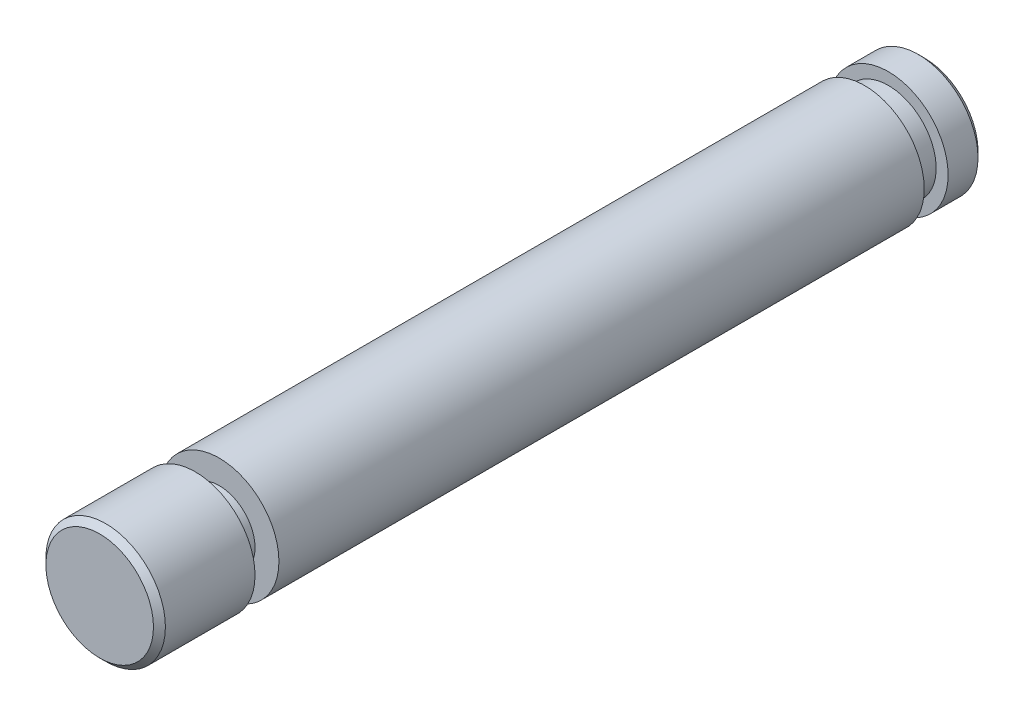
ISO-10303-21;
HEADER;
FILE_DESCRIPTION(('STEP AP214'),'2;1');
FILE_NAME('part.step','',(''),(''),'','','');
FILE_SCHEMA(('AUTOMOTIVE_DESIGN { 1 0 10303 214 1 1 1 1 }'));
ENDSEC;
DATA;
#1=APPLICATION_CONTEXT('core data for automotive mechanical design processes');
#2=APPLICATION_PROTOCOL_DEFINITION('international standard','automotive_design',2000,#1);
#3=PRODUCT_CONTEXT('',#1,'mechanical');
#4=PRODUCT('Part','Part','',(#3));
#5=PRODUCT_RELATED_PRODUCT_CATEGORY('part','',(#4));
#6=PRODUCT_DEFINITION_FORMATION('','',#4);
#7=PRODUCT_DEFINITION_CONTEXT('part definition',#1,'design');
#8=PRODUCT_DEFINITION('design','',#6,#7);
#9=PRODUCT_DEFINITION_SHAPE('','',#8);
#10=(LENGTH_UNIT() NAMED_UNIT(*) SI_UNIT(.MILLI.,.METRE.));
#11=(NAMED_UNIT(*) PLANE_ANGLE_UNIT() SI_UNIT($,.RADIAN.));
#12=(NAMED_UNIT(*) SI_UNIT($,.STERADIAN.) SOLID_ANGLE_UNIT());
#13=UNCERTAINTY_MEASURE_WITH_UNIT(LENGTH_MEASURE(1.E-05),#10,'distance_accuracy_value','');
#14=(GEOMETRIC_REPRESENTATION_CONTEXT(3) GLOBAL_UNCERTAINTY_ASSIGNED_CONTEXT((#13)) GLOBAL_UNIT_ASSIGNED_CONTEXT((#10,
#11,#12)) REPRESENTATION_CONTEXT('',''));
#15=CARTESIAN_POINT('',(0.,0.,0.));
#16=DIRECTION('',(0.,0.,1.));
#17=DIRECTION('',(1.,0.,0.));
#18=AXIS2_PLACEMENT_3D('',#15,#16,#17);
#19=CARTESIAN_POINT('',(0.,0.,-31.5));
#20=DIRECTION('',(0.,0.,-1.));
#21=DIRECTION('',(-1.,0.,0.));
#22=AXIS2_PLACEMENT_3D('',#19,#20,#21);
#23=PLANE('',#22);
#24=DIRECTION('',(-1.,0.,0.));
#25=VECTOR('',#24,1.);
#26=CARTESIAN_POINT('',(0.,1.5,-31.5));
#27=LINE('',#26,#25);
#28=CARTESIAN_POINT('',(-3.70809924354783,1.5,-31.5));
#29=VERTEX_POINT('',#28);
#30=CARTESIAN_POINT('',(-4.76969600708473,1.5,-31.5));
#31=VERTEX_POINT('',#30);
#32=EDGE_CURVE('E173',#29,#31,#27,.T.);
#33=ORIENTED_EDGE('',*,*,#32,.F.);
#34=CARTESIAN_POINT('',(0.,0.,-31.5));
#35=DIRECTION('',(0.,0.,-1.));
#36=DIRECTION('',(-1.,0.,0.));
#37=AXIS2_PLACEMENT_3D('',#34,#35,#36);
#38=CIRCLE('',#37,4.);
#39=CARTESIAN_POINT('',(-3.70809924354783,-1.5,-31.5));
#40=VERTEX_POINT('',#39);
#41=EDGE_CURVE('E181',#29,#40,#38,.T.);
#42=ORIENTED_EDGE('',*,*,#41,.T.);
#43=DIRECTION('',(-1.,0.,0.));
#44=VECTOR('',#43,1.);
#45=CARTESIAN_POINT('',(0.,-1.5,-31.5));
#46=LINE('',#45,#44);
#47=CARTESIAN_POINT('',(-4.76969600708473,-1.5,-31.5));
#48=VERTEX_POINT('',#47);
#49=EDGE_CURVE('E162',#40,#48,#46,.T.);
#50=ORIENTED_EDGE('',*,*,#49,.T.);
#51=CARTESIAN_POINT('',(0.,0.,-31.5));
#52=DIRECTION('',(0.,0.,-1.));
#53=DIRECTION('',(-1.,0.,0.));
#54=AXIS2_PLACEMENT_3D('',#51,#52,#53);
#55=CIRCLE('',#54,5.);
#56=EDGE_CURVE('E187',#31,#48,#55,.T.);
#57=ORIENTED_EDGE('',*,*,#56,.F.);
#58=EDGE_LOOP('',(#33,#42,#50,#57));
#59=FACE_BOUND('',#58,.T.);
#60=ADVANCED_FACE('F51',(#59),#23,.F.);
#61=CARTESIAN_POINT('',(0.,0.,-29.5));
#62=DIRECTION('',(0.,0.,-1.));
#63=DIRECTION('',(-1.,0.,0.));
#64=AXIS2_PLACEMENT_3D('',#61,#62,#63);
#65=PLANE('',#64);
#66=CARTESIAN_POINT('',(0.,0.,-29.5));
#67=DIRECTION('',(0.,0.,-1.));
#68=DIRECTION('',(-1.,0.,0.));
#69=AXIS2_PLACEMENT_3D('',#66,#67,#68);
#70=CIRCLE('',#69,4.);
#71=CARTESIAN_POINT('',(-3.70809924354783,1.5,-29.5));
#72=VERTEX_POINT('',#71);
#73=CARTESIAN_POINT('',(-3.70809924354783,-1.5,-29.5));
#74=VERTEX_POINT('',#73);
#75=EDGE_CURVE('E180',#72,#74,#70,.T.);
#76=ORIENTED_EDGE('',*,*,#75,.F.);
#77=DIRECTION('',(-1.,0.,0.));
#78=VECTOR('',#77,1.);
#79=CARTESIAN_POINT('',(0.,1.5,-29.5));
#80=LINE('',#79,#78);
#81=CARTESIAN_POINT('',(-4.76969600708473,1.5,-29.5));
#82=VERTEX_POINT('',#81);
#83=EDGE_CURVE('E177',#72,#82,#80,.T.);
#84=ORIENTED_EDGE('',*,*,#83,.T.);
#85=CARTESIAN_POINT('',(0.,0.,-29.5));
#86=DIRECTION('',(0.,0.,-1.));
#87=DIRECTION('',(-1.,0.,0.));
#88=AXIS2_PLACEMENT_3D('',#85,#86,#87);
#89=CIRCLE('',#88,5.);
#90=CARTESIAN_POINT('',(-4.76969600708473,-1.5,-29.5));
#91=VERTEX_POINT('',#90);
#92=EDGE_CURVE('E184',#82,#91,#89,.T.);
#93=ORIENTED_EDGE('',*,*,#92,.T.);
#94=DIRECTION('',(-1.,0.,0.));
#95=VECTOR('',#94,1.);
#96=CARTESIAN_POINT('',(0.,-1.5,-29.5));
#97=LINE('',#96,#95);
#98=EDGE_CURVE('E168',#74,#91,#97,.T.);
#99=ORIENTED_EDGE('',*,*,#98,.F.);
#100=EDGE_LOOP('',(#76,#84,#93,#99));
#101=FACE_BOUND('',#100,.T.);
#102=ADVANCED_FACE('F240',(#101),#65,.T.);
#103=CARTESIAN_POINT('',(0.,0.,-31.5));
#104=DIRECTION('',(0.,0.,1.));
#105=DIRECTION('',(1.,0.,0.));
#106=AXIS2_PLACEMENT_3D('',#103,#104,#105);
#107=CYLINDRICAL_SURFACE('',#106,4.);
#108=DIRECTION('',(0.,0.,1.));
#109=VECTOR('',#108,1.);
#110=CARTESIAN_POINT('',(-3.70809924354783,1.5,-31.5));
#111=LINE('',#110,#109);
#112=EDGE_CURVE('E175',#72,#29,#111,.F.);
#113=ORIENTED_EDGE('',*,*,#112,.F.);
#114=ORIENTED_EDGE('',*,*,#75,.T.);
#115=DIRECTION('',(0.,0.,1.));
#116=VECTOR('',#115,1.);
#117=CARTESIAN_POINT('',(-3.70809924354783,-1.5,-31.5));
#118=LINE('',#117,#116);
#119=EDGE_CURVE('E165',#74,#40,#118,.F.);
#120=ORIENTED_EDGE('',*,*,#119,.T.);
#121=ORIENTED_EDGE('',*,*,#41,.F.);
#122=EDGE_LOOP('',(#113,#114,#120,#121));
#123=FACE_BOUND('',#122,.T.);
#124=ADVANCED_FACE('F236',(#123),#107,.T.);
#125=CARTESIAN_POINT('',(0.,0.,-34.5));
#126=DIRECTION('',(0.,0.,1.));
#127=DIRECTION('',(1.,0.,0.));
#128=AXIS2_PLACEMENT_3D('',#125,#126,#127);
#129=PLANE('',#128);
#130=DIRECTION('',(1.,0.,0.));
#131=VECTOR('',#130,1.);
#132=CARTESIAN_POINT('',(-5.,1.5,-34.5));
#133=LINE('',#132,#131);
#134=CARTESIAN_POINT('',(-4.24264068711929,1.5,-34.5));
#135=VERTEX_POINT('',#134);
#136=CARTESIAN_POINT('',(-3.2,1.5,-34.5));
#137=VERTEX_POINT('',#136);
#138=EDGE_CURVE('E157',#135,#137,#133,.T.);
#139=ORIENTED_EDGE('',*,*,#138,.F.);
#140=CARTESIAN_POINT('',(0.,0.,-34.5));
#141=DIRECTION('',(0.,0.,1.));
#142=DIRECTION('',(1.,0.,0.));
#143=AXIS2_PLACEMENT_3D('',#140,#141,#142);
#144=CIRCLE('',#143,4.5);
#145=CARTESIAN_POINT('',(-4.24264068711929,-1.5,-34.5));
#146=VERTEX_POINT('',#145);
#147=EDGE_CURVE('E213',#135,#146,#144,.F.);
#148=ORIENTED_EDGE('',*,*,#147,.T.);
#149=DIRECTION('',(1.,0.,0.));
#150=VECTOR('',#149,1.);
#151=CARTESIAN_POINT('',(-5.,-1.5,-34.5));
#152=LINE('',#151,#150);
#153=CARTESIAN_POINT('',(-3.2,-1.5,-34.5));
#154=VERTEX_POINT('',#153);
#155=EDGE_CURVE('E74',#146,#154,#152,.T.);
#156=ORIENTED_EDGE('',*,*,#155,.T.);
#157=DIRECTION('',(0.,-1.,0.));
#158=VECTOR('',#157,1.);
#159=CARTESIAN_POINT('',(-3.2,1.5,-34.5));
#160=LINE('',#159,#158);
#161=EDGE_CURVE('E146',#137,#154,#160,.T.);
#162=ORIENTED_EDGE('',*,*,#161,.F.);
#163=EDGE_LOOP('',(#139,#148,#156,#162));
#164=FACE_BOUND('',#163,.T.);
#165=ADVANCED_FACE('F239',(#164),#129,.F.);
#166=CARTESIAN_POINT('',(0.,0.,34.5));
#167=DIRECTION('',(0.,0.,-1.));
#168=DIRECTION('',(-1.,0.,0.));
#169=AXIS2_PLACEMENT_3D('',#166,#167,#168);
#170=CYLINDRICAL_SURFACE('',#169,5.);
#171=DIRECTION('',(0.,0.,-1.));
#172=VECTOR('',#171,1.);
#173=CARTESIAN_POINT('',(-4.76969600708473,1.5,34.5));
#174=LINE('',#173,#172);
#175=CARTESIAN_POINT('',(-4.76969600708473,1.5,-34.));
#176=VERTEX_POINT('',#175);
#177=EDGE_CURVE('E171',#31,#176,#174,.T.);
#178=ORIENTED_EDGE('',*,*,#177,.F.);
#179=ORIENTED_EDGE('',*,*,#56,.T.);
#180=DIRECTION('',(0.,0.,-1.));
#181=VECTOR('',#180,1.);
#182=CARTESIAN_POINT('',(-4.76969600708473,-1.5,34.5));
#183=LINE('',#182,#181);
#184=CARTESIAN_POINT('',(-4.76969600708473,-1.5,-34.));
#185=VERTEX_POINT('',#184);
#186=EDGE_CURVE('E156',#48,#185,#183,.T.);
#187=ORIENTED_EDGE('',*,*,#186,.T.);
#188=CARTESIAN_POINT('',(0.,0.,-34.));
#189=DIRECTION('',(0.,0.,1.));
#190=DIRECTION('',(1.,0.,0.));
#191=AXIS2_PLACEMENT_3D('',#188,#189,#190);
#192=CIRCLE('',#191,5.);
#193=EDGE_CURVE('E210',#185,#176,#192,.T.);
#194=ORIENTED_EDGE('',*,*,#193,.T.);
#195=EDGE_LOOP('',(#178,#179,#187,#194));
#196=FACE_BOUND('',#195,.T.);
#197=ADVANCED_FACE('F266',(#196),#170,.T.);
#198=CARTESIAN_POINT('',(0.,0.,-34.));
#199=DIRECTION('',(0.,0.,1.));
#200=DIRECTION('',(1.,0.,0.));
#201=AXIS2_PLACEMENT_3D('',#198,#199,#200);
#202=CONICAL_SURFACE('',#201,5.,0.785398163397443);
#203=ORIENTED_EDGE('',*,*,#147,.F.);
#204=CARTESIAN_POINT('',(-2.16230427521784,1.5,-36.3683541692269));
#205=CARTESIAN_POINT('',(-2.26170328637368,1.5,-36.2866237657248));
#206=CARTESIAN_POINT('',(-2.36025529148759,1.5,-36.2038798963738));
#207=CARTESIAN_POINT('',(-2.55600046714587,1.5,-36.036817134977));
#208=CARTESIAN_POINT('',(-2.65319376997426,1.5,-35.9524983981551));
#209=CARTESIAN_POINT('',(-2.84655338557445,1.5,-35.7827415296879));
#210=CARTESIAN_POINT('',(-2.94271993398821,1.5,-35.6973036653634));
#211=CARTESIAN_POINT('',(-3.13426650601756,1.5,-35.5255461820675));
#212=CARTESIAN_POINT('',(-3.22964650729755,1.5,-35.439226538211));
#213=CARTESIAN_POINT('',(-3.51479588177239,1.5,-35.1793145483203));
#214=CARTESIAN_POINT('',(-3.70364165468618,1.5,-35.0047097694588));
#215=CARTESIAN_POINT('',(-4.0797362886616,1.5,-34.6537692558707));
#216=CARTESIAN_POINT('',(-4.26698503752829,1.5,-34.4774334013733));
#217=CARTESIAN_POINT('',(-4.64263193370613,1.5,-34.1214350657471));
#218=CARTESIAN_POINT('',(-4.83101642797462,1.5,-33.9417581905171));
#219=CARTESIAN_POINT('',(-5.20695991744704,1.5,-33.5815548756563));
#220=CARTESIAN_POINT('',(-5.39451893661307,1.5,-33.4010284610051));
#221=CARTESIAN_POINT('',(-5.76908741339747,1.5,-33.0392956468262));
#222=CARTESIAN_POINT('',(-5.95609669115696,1.5,-32.8580890611849));
#223=CARTESIAN_POINT('',(-6.32964554688914,1.5,-32.4951934856952));
#224=CARTESIAN_POINT('',(-6.51618512637662,1.5,-32.3135044974066));
#225=CARTESIAN_POINT('',(-6.70255839168424,1.5,-32.1316458307731));
#226=B_SPLINE_CURVE_WITH_KNOTS('',3,(#204,#205,#206,#207,#208,#209,#210,#211,#212,#213,#214,
#215,#216,#217,#218,#219,#220,#221,#222,#223,#224,#225),.UNSPECIFIED.,.F.,.F.,(4,2,2,2,2,2,2,2,
2,2,4),(0.,0.386035334138068,0.772032818161416,1.15793972383208,1.54385755063091,
2.31542460009282,3.08704541483162,3.86803599873153,4.64900376030176,5.43020358119426,
6.21140087945938),.UNSPECIFIED.);
#227=EDGE_CURVE('E67',#135,#176,#226,.T.);
#228=ORIENTED_EDGE('',*,*,#227,.T.);
#229=ORIENTED_EDGE('',*,*,#193,.F.);
#230=CARTESIAN_POINT('',(-2.16230427521784,-1.5,-36.3683541692269));
#231=CARTESIAN_POINT('',(-2.26170328637368,-1.5,-36.2866237657248));
#232=CARTESIAN_POINT('',(-2.36025529148759,-1.5,-36.2038798963738));
#233=CARTESIAN_POINT('',(-2.55600046714587,-1.5,-36.036817134977));
#234=CARTESIAN_POINT('',(-2.65319376997426,-1.5,-35.9524983981551));
#235=CARTESIAN_POINT('',(-2.84655338557445,-1.5,-35.7827415296879));
#236=CARTESIAN_POINT('',(-2.94271993398821,-1.5,-35.6973036653634));
#237=CARTESIAN_POINT('',(-3.13426650601756,-1.5,-35.5255461820675));
#238=CARTESIAN_POINT('',(-3.22964650729755,-1.5,-35.439226538211));
#239=CARTESIAN_POINT('',(-3.51479588177239,-1.5,-35.1793145483203));
#240=CARTESIAN_POINT('',(-3.70364165468618,-1.5,-35.0047097694588));
#241=CARTESIAN_POINT('',(-4.07973628866161,-1.5,-34.6537692558707));
#242=CARTESIAN_POINT('',(-4.26698503752829,-1.5,-34.4774334013733));
#243=CARTESIAN_POINT('',(-4.64263193370613,-1.5,-34.1214350657471));
#244=CARTESIAN_POINT('',(-4.83101642797462,-1.5,-33.9417581905171));
#245=CARTESIAN_POINT('',(-5.20695991744704,-1.5,-33.5815548756563));
#246=CARTESIAN_POINT('',(-5.39451893661307,-1.5,-33.4010284610051));
#247=CARTESIAN_POINT('',(-5.76908741339747,-1.5,-33.0392956468262));
#248=CARTESIAN_POINT('',(-5.95609669115697,-1.5,-32.8580890611849));
#249=CARTESIAN_POINT('',(-6.32964554688914,-1.5,-32.4951934856952));
#250=CARTESIAN_POINT('',(-6.51618512637662,-1.5,-32.3135044974066));
#251=CARTESIAN_POINT('',(-6.70255839168424,-1.5,-32.1316458307731));
#252=B_SPLINE_CURVE_WITH_KNOTS('',3,(#230,#231,#232,#233,#234,#235,#236,#237,#238,#239,#240,
#241,#242,#243,#244,#245,#246,#247,#248,#249,#250,#251),.UNSPECIFIED.,.F.,.F.,(4,2,2,2,2,2,2,2,
2,2,4),(0.,0.386035334138068,0.772032818161416,1.15793972383208,1.54385755063091,
2.31542460009283,3.08704541483162,3.86803599873152,4.64900376030176,5.43020358119427,
6.21140087945938),.UNSPECIFIED.);
#253=EDGE_CURVE('E216',#146,#185,#252,.T.);
#254=ORIENTED_EDGE('',*,*,#253,.F.);
#255=EDGE_LOOP('',(#203,#228,#229,#254));
#256=FACE_BOUND('',#255,.T.);
#257=ADVANCED_FACE('F54',(#256),#202,.T.);
#258=CARTESIAN_POINT('',(0.,0.,24.5));
#259=DIRECTION('',(0.,0.,1.));
#260=DIRECTION('',(1.,0.,0.));
#261=AXIS2_PLACEMENT_3D('',#258,#259,#260);
#262=CIRCLE('',#261,5.);
#263=CARTESIAN_POINT('',(5.,0.,24.5));
#264=VERTEX_POINT('',#263);
#265=EDGE_CURVE('E196',#264,#264,#262,.T.);
#266=ORIENTED_EDGE('',*,*,#265,.F.);
#267=EDGE_LOOP('',(#266));
#268=FACE_BOUND('',#267,.T.);
#269=DIRECTION('',(0.,0.,-1.));
#270=VECTOR('',#269,1.);
#271=CARTESIAN_POINT('',(-4.76969600708473,1.5,34.5));
#272=LINE('',#271,#270);
#273=CARTESIAN_POINT('',(-4.76969600708473,1.5,-8.));
#274=VERTEX_POINT('',#273);
#275=EDGE_CURVE('E82',#274,#82,#272,.T.);
#276=ORIENTED_EDGE('',*,*,#275,.F.);
#277=CARTESIAN_POINT('',(-4.76969600708473,1.5,-8.));
#278=CARTESIAN_POINT('',(-4.76969249084934,1.50000085357071,-7.95882060709199));
#279=CARTESIAN_POINT('',(-4.77022997000129,1.49830317083428,-7.91766195687388));
#280=CARTESIAN_POINT('',(-4.77235095109999,1.49153785660317,-7.83565883790444));
#281=CARTESIAN_POINT('',(-4.77393421787376,1.48647098275841,-7.79481430060511));
#282=CARTESIAN_POINT('',(-4.78018490618873,1.46630203689311,-7.67340945904534));
#283=CARTESIAN_POINT('',(-4.78635370384275,1.44623120413662,-7.59369360958363));
#284=CARTESIAN_POINT('',(-4.80195952113208,1.39353102315626,-7.43896442161414));
#285=CARTESIAN_POINT('',(-4.81139539670393,1.36090607068203,-7.36394944780192));
#286=CARTESIAN_POINT('',(-4.83246571212052,1.28407841117655,-7.22040331840241));
#287=CARTESIAN_POINT('',(-4.84410117434933,1.23987031651226,-7.15187520027157));
#288=CARTESIAN_POINT('',(-4.86866835244721,1.13964850658326,-7.02113394400295));
#289=CARTESIAN_POINT('',(-4.88162755412974,1.08333433465208,-6.9591563396566));
#290=CARTESIAN_POINT('',(-4.90714811559049,0.961138919873353,-6.84536441610004));
#291=CARTESIAN_POINT('',(-4.91970940785249,0.895256063916347,-6.79355181399695));
#292=CARTESIAN_POINT('',(-4.94333239727705,0.754109921315429,-6.70053622968151));
#293=CARTESIAN_POINT('',(-4.95435770971354,0.678680819336258,-6.65957481970205));
#294=CARTESIAN_POINT('',(-4.97334469846208,0.521621185505773,-6.59101158838185));
#295=CARTESIAN_POINT('',(-4.98130716463903,0.439992259012926,-6.56340632220572));
#296=CARTESIAN_POINT('',(-4.99307639935002,0.275324697874877,-6.52312020089795));
#297=CARTESIAN_POINT('',(-4.99699549276993,0.192393125294253,-6.51003514203026));
#298=CARTESIAN_POINT('',(-5.00063202022426,0.025423571998081,-6.49788265863674));
#299=CARTESIAN_POINT('',(-5.00035024971471,-0.0586141962423633,-6.49881258029984));
#300=CARTESIAN_POINT('',(-4.99569602566267,-0.222571599946018,-6.514392908759));
#301=CARTESIAN_POINT('',(-4.99145415509187,-0.302537145464642,-6.52860534497872));
#302=CARTESIAN_POINT('',(-4.9795151369998,-0.458890052102026,-6.56963163523811));
#303=CARTESIAN_POINT('',(-4.97181780846028,-0.535277225531998,-6.59644614945594));
#304=CARTESIAN_POINT('',(-4.95365214926145,-0.683347815892217,-6.66221222164644));
#305=CARTESIAN_POINT('',(-4.94315255692525,-0.754966006044143,-6.70130164435694));
#306=CARTESIAN_POINT('',(-4.92049624651755,-0.890765529574421,-6.79039859004832));
#307=CARTESIAN_POINT('',(-4.90833915735884,-0.954945191614595,-6.84040855947884));
#308=CARTESIAN_POINT('',(-4.88311673571409,-1.07665450541275,-6.95219198808351));
#309=CARTESIAN_POINT('',(-4.87003445449553,-1.13383351478034,-7.01434386376075));
#310=CARTESIAN_POINT('',(-4.84484215114658,-1.23706769492487,-7.14749742342792));
#311=CARTESIAN_POINT('',(-4.83273241337565,-1.28311962013078,-7.21850168036553));
#312=CARTESIAN_POINT('',(-4.81077228795653,-1.36316407240863,-7.36828092844929));
#313=CARTESIAN_POINT('',(-4.80094596245948,-1.39703006341135,-7.44712717959341));
#314=CARTESIAN_POINT('',(-4.78495663653201,-1.45085886004699,-7.60972450398175));
#315=CARTESIAN_POINT('',(-4.77878803475875,-1.47084293218035,-7.69346786071438));
#316=CARTESIAN_POINT('',(-4.77314032325006,-1.4890120359008,-7.81499488907019));
#317=CARTESIAN_POINT('',(-4.77185156275267,-1.49313202989009,-7.85189073417961));
#318=CARTESIAN_POINT('',(-4.77012928611782,-1.49862355614854,-7.92585147909953));
#319=CARTESIAN_POINT('',(-4.76969451246644,-1.49999912968269,-7.96291604966386));
#320=CARTESIAN_POINT('',(-4.76969600708473,-1.5,-8.));
#321=B_SPLINE_CURVE_WITH_KNOTS('',3,(#277,#278,#279,#280,#281,#282,#283,#284,#285,#286,#287,
#288,#289,#290,#291,#292,#293,#294,#295,#296,#297,#298,#299,#300,#301,#302,#303,#304,#305,#306,
#307,#308,#309,#310,#311,#312,#313,#314,#315,#316,#317,#318,#319,#320),.UNSPECIFIED.,.F.,.F.,(4,
2,2,2,2,2,2,2,2,2,2,2,2,2,2,2,2,2,2,2,2,4),(0.,0.123459071219734,0.246890388853043,
0.492911349615211,0.738846245884325,0.984895736828093,1.23795510798803,1.49105719006936,
1.74939356197455,2.00766326783256,2.25854751319802,2.5093842528947,2.75223130012966,
2.99509107067836,3.2407824256273,3.48652887757005,3.74172568310981,3.99699683536777,
4.25484698071527,4.51230123440207,4.62365084745809,4.73483637253615),.UNSPECIFIED.);
#322=CARTESIAN_POINT('',(-4.76969600708473,-1.5,-8.));
#323=VERTEX_POINT('',#322);
#324=EDGE_CURVE('E11',#274,#323,#321,.T.);
#325=ORIENTED_EDGE('',*,*,#324,.T.);
#326=DIRECTION('',(0.,0.,-1.));
#327=VECTOR('',#326,1.);
#328=CARTESIAN_POINT('',(-4.76969600708473,-1.5,34.5));
#329=LINE('',#328,#327);
#330=EDGE_CURVE('E135',#323,#91,#329,.T.);
#331=ORIENTED_EDGE('',*,*,#330,.T.);
#332=ORIENTED_EDGE('',*,*,#92,.F.);
#333=EDGE_LOOP('',(#276,#325,#331,#332));
#334=FACE_BOUND('',#333,.T.);
#335=ADVANCED_FACE('F270',(#268,#334),#170,.T.);
#336=CARTESIAN_POINT('',(0.,0.,34.));
#337=DIRECTION('',(0.,0.,1.));
#338=DIRECTION('',(1.,0.,0.));
#339=AXIS2_PLACEMENT_3D('',#336,#337,#338);
#340=CIRCLE('',#339,5.);
#341=CARTESIAN_POINT('',(5.,0.,34.));
#342=VERTEX_POINT('',#341);
#343=EDGE_CURVE('E207',#342,#342,#340,.F.);
#344=ORIENTED_EDGE('',*,*,#343,.T.);
#345=EDGE_LOOP('',(#344));
#346=FACE_BOUND('',#345,.T.);
#347=CARTESIAN_POINT('',(0.,0.,26.5));
#348=DIRECTION('',(0.,0.,1.));
#349=DIRECTION('',(1.,0.,0.));
#350=AXIS2_PLACEMENT_3D('',#347,#348,#349);
#351=CIRCLE('',#350,5.);
#352=CARTESIAN_POINT('',(5.,0.,26.5));
#353=VERTEX_POINT('',#352);
#354=EDGE_CURVE('E199',#353,#353,#351,.T.);
#355=ORIENTED_EDGE('',*,*,#354,.T.);
#356=EDGE_LOOP('',(#355));
#357=FACE_BOUND('',#356,.T.);
#358=ADVANCED_FACE('F263',(#346,#357),#170,.T.);
#359=CARTESIAN_POINT('',(0.,0.,34.5));
#360=DIRECTION('',(0.,0.,1.));
#361=DIRECTION('',(1.,0.,0.));
#362=AXIS2_PLACEMENT_3D('',#359,#360,#361);
#363=PLANE('',#362);
#364=CARTESIAN_POINT('',(0.,0.,34.5));
#365=DIRECTION('',(0.,0.,1.));
#366=DIRECTION('',(1.,0.,0.));
#367=AXIS2_PLACEMENT_3D('',#364,#365,#366);
#368=CIRCLE('',#367,4.5);
#369=CARTESIAN_POINT('',(4.5,0.,34.5));
#370=VERTEX_POINT('',#369);
#371=EDGE_CURVE('E202',#370,#370,#368,.T.);
#372=ORIENTED_EDGE('',*,*,#371,.T.);
#373=EDGE_LOOP('',(#372));
#374=FACE_BOUND('',#373,.T.);
#375=ADVANCED_FACE('F256',(#374),#363,.T.);
#376=CARTESIAN_POINT('',(0.,0.,26.5));
#377=DIRECTION('',(0.,0.,1.));
#378=DIRECTION('',(1.,0.,0.));
#379=AXIS2_PLACEMENT_3D('',#376,#377,#378);
#380=PLANE('',#379);
#381=ORIENTED_EDGE('',*,*,#354,.F.);
#382=EDGE_LOOP('',(#381));
#383=FACE_BOUND('',#382,.T.);
#384=CARTESIAN_POINT('',(0.,0.,26.5));
#385=DIRECTION('',(0.,0.,1.));
#386=DIRECTION('',(1.,0.,0.));
#387=AXIS2_PLACEMENT_3D('',#384,#385,#386);
#388=CIRCLE('',#387,3.);
#389=CARTESIAN_POINT('',(3.,0.,26.5));
#390=VERTEX_POINT('',#389);
#391=EDGE_CURVE('E193',#390,#390,#388,.T.);
#392=ORIENTED_EDGE('',*,*,#391,.T.);
#393=EDGE_LOOP('',(#392));
#394=FACE_BOUND('',#393,.T.);
#395=ADVANCED_FACE('F253',(#383,#394),#380,.F.);
#396=CARTESIAN_POINT('',(0.,0.,24.5));
#397=DIRECTION('',(0.,0.,1.));
#398=DIRECTION('',(1.,0.,0.));
#399=AXIS2_PLACEMENT_3D('',#396,#397,#398);
#400=PLANE('',#399);
#401=ORIENTED_EDGE('',*,*,#265,.T.);
#402=EDGE_LOOP('',(#401));
#403=FACE_BOUND('',#402,.T.);
#404=CARTESIAN_POINT('',(0.,0.,24.5));
#405=DIRECTION('',(0.,0.,1.));
#406=DIRECTION('',(1.,0.,0.));
#407=AXIS2_PLACEMENT_3D('',#404,#405,#406);
#408=CIRCLE('',#407,3.);
#409=CARTESIAN_POINT('',(3.,0.,24.5));
#410=VERTEX_POINT('',#409);
#411=EDGE_CURVE('E190',#410,#410,#408,.T.);
#412=ORIENTED_EDGE('',*,*,#411,.F.);
#413=EDGE_LOOP('',(#412));
#414=FACE_BOUND('',#413,.T.);
#415=ADVANCED_FACE('F251',(#403,#414),#400,.T.);
#416=CARTESIAN_POINT('',(0.,0.,26.5));
#417=DIRECTION('',(0.,0.,-1.));
#418=DIRECTION('',(-1.,0.,0.));
#419=AXIS2_PLACEMENT_3D('',#416,#417,#418);
#420=CYLINDRICAL_SURFACE('',#419,3.);
#421=ORIENTED_EDGE('',*,*,#391,.F.);
#422=EDGE_LOOP('',(#421));
#423=FACE_BOUND('',#422,.T.);
#424=ORIENTED_EDGE('',*,*,#411,.T.);
#425=EDGE_LOOP('',(#424));
#426=FACE_BOUND('',#425,.T.);
#427=ADVANCED_FACE('F248',(#423,#426),#420,.T.);
#428=CARTESIAN_POINT('',(0.,0.,34.5));
#429=DIRECTION('',(0.,0.,-1.));
#430=DIRECTION('',(-1.,0.,0.));
#431=AXIS2_PLACEMENT_3D('',#428,#429,#430);
#432=CONICAL_SURFACE('',#431,4.5,0.78539816339745);
#433=ORIENTED_EDGE('',*,*,#343,.F.);
#434=EDGE_LOOP('',(#433));
#435=FACE_BOUND('',#434,.T.);
#436=ORIENTED_EDGE('',*,*,#371,.F.);
#437=EDGE_LOOP('',(#436));
#438=FACE_BOUND('',#437,.T.);
#439=ADVANCED_FACE('F235',(#435,#438),#432,.T.);
#440=CARTESIAN_POINT('',(-5.,0.,-8.));
#441=DIRECTION('',(1.,0.,0.));
#442=DIRECTION('',(0.,0.,-1.));
#443=AXIS2_PLACEMENT_3D('',#440,#441,#442);
#444=CYLINDRICAL_SURFACE('',#443,1.5);
#445=DIRECTION('',(1.,0.,0.));
#446=VECTOR('',#445,1.);
#447=CARTESIAN_POINT('',(-5.,1.5,-8.));
#448=LINE('',#447,#446);
#449=CARTESIAN_POINT('',(-3.2,1.5,-8.));
#450=VERTEX_POINT('',#449);
#451=EDGE_CURVE('E149',#274,#450,#448,.T.);
#452=ORIENTED_EDGE('',*,*,#451,.T.);
#453=CARTESIAN_POINT('',(-3.2,0.,-8.));
#454=DIRECTION('',(1.,0.,0.));
#455=DIRECTION('',(0.,0.,-1.));
#456=AXIS2_PLACEMENT_3D('',#453,#454,#455);
#457=CIRCLE('',#456,1.5);
#458=CARTESIAN_POINT('',(-3.2,-1.5,-8.));
#459=VERTEX_POINT('',#458);
#460=EDGE_CURVE('E144',#450,#459,#457,.T.);
#461=ORIENTED_EDGE('',*,*,#460,.T.);
#462=DIRECTION('',(1.,0.,0.));
#463=VECTOR('',#462,1.);
#464=CARTESIAN_POINT('',(-5.,-1.5,-8.));
#465=LINE('',#464,#463);
#466=EDGE_CURVE('E130',#323,#459,#465,.T.);
#467=ORIENTED_EDGE('',*,*,#466,.F.);
#468=ORIENTED_EDGE('',*,*,#324,.F.);
#469=EDGE_LOOP('',(#452,#461,#467,#468));
#470=FACE_BOUND('',#469,.T.);
#471=ADVANCED_FACE('F148',(#470),#444,.F.);
#472=CARTESIAN_POINT('',(-5.,1.5,-8.));
#473=DIRECTION('',(0.,-1.,0.));
#474=DIRECTION('',(0.,0.,-1.));
#475=AXIS2_PLACEMENT_3D('',#472,#473,#474);
#476=PLANE('',#475);
#477=ORIENTED_EDGE('',*,*,#275,.T.);
#478=ORIENTED_EDGE('',*,*,#83,.F.);
#479=ORIENTED_EDGE('',*,*,#112,.T.);
#480=ORIENTED_EDGE('',*,*,#32,.T.);
#481=ORIENTED_EDGE('',*,*,#177,.T.);
#482=ORIENTED_EDGE('',*,*,#227,.F.);
#483=ORIENTED_EDGE('',*,*,#138,.T.);
#484=DIRECTION('',(0.,0.,-1.));
#485=VECTOR('',#484,1.);
#486=CARTESIAN_POINT('',(-3.2,1.5,-8.));
#487=LINE('',#486,#485);
#488=EDGE_CURVE('E138',#450,#137,#487,.T.);
#489=ORIENTED_EDGE('',*,*,#488,.F.);
#490=ORIENTED_EDGE('',*,*,#451,.F.);
#491=EDGE_LOOP('',(#477,#478,#479,#480,#481,#482,#483,#489,#490));
#492=FACE_BOUND('',#491,.T.);
#493=ADVANCED_FACE('F229',(#492),#476,.T.);
#494=CARTESIAN_POINT('',(-5.,-1.5,-8.));
#495=DIRECTION('',(0.,-1.,0.));
#496=DIRECTION('',(0.,0.,-1.));
#497=AXIS2_PLACEMENT_3D('',#494,#495,#496);
#498=PLANE('',#497);
#499=ORIENTED_EDGE('',*,*,#466,.T.);
#500=DIRECTION('',(0.,0.,-1.));
#501=VECTOR('',#500,1.);
#502=CARTESIAN_POINT('',(-3.2,-1.5,-8.));
#503=LINE('',#502,#501);
#504=EDGE_CURVE('E133',#459,#154,#503,.T.);
#505=ORIENTED_EDGE('',*,*,#504,.T.);
#506=ORIENTED_EDGE('',*,*,#155,.F.);
#507=ORIENTED_EDGE('',*,*,#253,.T.);
#508=ORIENTED_EDGE('',*,*,#186,.F.);
#509=ORIENTED_EDGE('',*,*,#49,.F.);
#510=ORIENTED_EDGE('',*,*,#119,.F.);
#511=ORIENTED_EDGE('',*,*,#98,.T.);
#512=ORIENTED_EDGE('',*,*,#330,.F.);
#513=EDGE_LOOP('',(#499,#505,#506,#507,#508,#509,#510,#511,#512));
#514=FACE_BOUND('',#513,.T.);
#515=ADVANCED_FACE('F132',(#514),#498,.F.);
#516=CARTESIAN_POINT('',(-3.2,0.,-8.));
#517=DIRECTION('',(1.,0.,0.));
#518=DIRECTION('',(0.,0.,-1.));
#519=AXIS2_PLACEMENT_3D('',#516,#517,#518);
#520=PLANE('',#519);
#521=ORIENTED_EDGE('',*,*,#460,.F.);
#522=ORIENTED_EDGE('',*,*,#488,.T.);
#523=ORIENTED_EDGE('',*,*,#161,.T.);
#524=ORIENTED_EDGE('',*,*,#504,.F.);
#525=EDGE_LOOP('',(#521,#522,#523,#524));
#526=FACE_BOUND('',#525,.T.);
#527=ADVANCED_FACE('F142',(#526),#520,.F.);
#528=CLOSED_SHELL('',(#60,#102,#124,#165,#197,#257,#335,#358,#375,#395,#415,#427,#439,#471,#493,
#515,#527));
#529=MANIFOLD_SOLID_BREP('B2',#528);
#530=ADVANCED_BREP_SHAPE_REPRESENTATION('',(#18,#529),#14);
#531=SHAPE_DEFINITION_REPRESENTATION(#9,#530);
ENDSEC;
END-ISO-10303-21;
